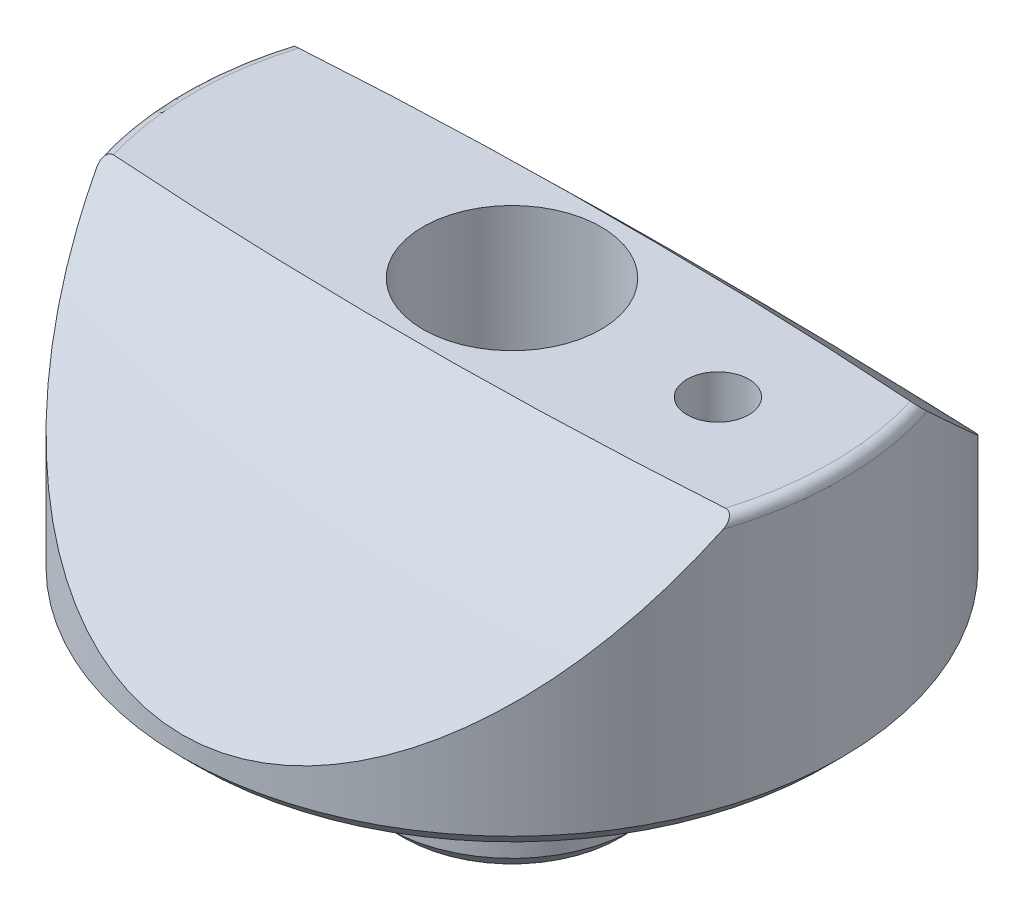
ISO-10303-21;
HEADER;
FILE_DESCRIPTION(('STEP AP214'),'2;1');
FILE_NAME('part.step','',(''),(''),'','','');
FILE_SCHEMA(('AUTOMOTIVE_DESIGN { 1 0 10303 214 1 1 1 1 }'));
ENDSEC;
DATA;
#1=APPLICATION_CONTEXT('core data for automotive mechanical design processes');
#2=APPLICATION_PROTOCOL_DEFINITION('international standard','automotive_design',2000,#1);
#3=PRODUCT_CONTEXT('',#1,'mechanical');
#4=PRODUCT('Part','Part','',(#3));
#5=PRODUCT_RELATED_PRODUCT_CATEGORY('part','',(#4));
#6=PRODUCT_DEFINITION_FORMATION('','',#4);
#7=PRODUCT_DEFINITION_CONTEXT('part definition',#1,'design');
#8=PRODUCT_DEFINITION('design','',#6,#7);
#9=PRODUCT_DEFINITION_SHAPE('','',#8);
#10=(LENGTH_UNIT() NAMED_UNIT(*) SI_UNIT(.MILLI.,.METRE.));
#11=(NAMED_UNIT(*) PLANE_ANGLE_UNIT() SI_UNIT($,.RADIAN.));
#12=(NAMED_UNIT(*) SI_UNIT($,.STERADIAN.) SOLID_ANGLE_UNIT());
#13=UNCERTAINTY_MEASURE_WITH_UNIT(LENGTH_MEASURE(1.E-05),#10,'distance_accuracy_value','');
#14=(GEOMETRIC_REPRESENTATION_CONTEXT(3) GLOBAL_UNCERTAINTY_ASSIGNED_CONTEXT((#13)) GLOBAL_UNIT_ASSIGNED_CONTEXT((#10,
#11,#12)) REPRESENTATION_CONTEXT('',''));
#15=CARTESIAN_POINT('',(0.,0.,0.));
#16=DIRECTION('',(0.,0.,1.));
#17=DIRECTION('',(1.,0.,0.));
#18=AXIS2_PLACEMENT_3D('',#15,#16,#17);
#19=CARTESIAN_POINT('',(9.525,0.,0.));
#20=DIRECTION('',(0.,1.,0.));
#21=DIRECTION('',(0.,0.,1.));
#22=AXIS2_PLACEMENT_3D('',#19,#20,#21);
#23=PLANE('',#22);
#24=CARTESIAN_POINT('',(0.,0.,0.));
#25=DIRECTION('',(0.,1.,0.));
#26=DIRECTION('',(0.,0.,1.));
#27=AXIS2_PLACEMENT_3D('',#24,#25,#26);
#28=CIRCLE('',#27,11.1939614104249);
#29=CARTESIAN_POINT('',(0.,0.,11.1939614104249));
#30=VERTEX_POINT('',#29);
#31=EDGE_CURVE('E507',#30,#30,#28,.F.);
#32=ORIENTED_EDGE('',*,*,#31,.F.);
#33=EDGE_LOOP('',(#32));
#34=FACE_BOUND('',#33,.T.);
#35=CARTESIAN_POINT('',(0.,0.,0.));
#36=DIRECTION('',(0.,-1.,0.));
#37=DIRECTION('',(0.,0.,-1.));
#38=AXIS2_PLACEMENT_3D('',#35,#36,#37);
#39=CIRCLE('',#38,16.4465);
#40=CARTESIAN_POINT('',(16.27819325,0.,2.34686743674508));
#41=VERTEX_POINT('',#40);
#42=CARTESIAN_POINT('',(16.27819325,0.,-2.34686743674508));
#43=VERTEX_POINT('',#42);
#44=EDGE_CURVE('E398',#41,#43,#39,.T.);
#45=ORIENTED_EDGE('',*,*,#44,.T.);
#46=CARTESIAN_POINT('',(15.875,0.,0.));
#47=DIRECTION('',(0.,1.,0.));
#48=DIRECTION('',(0.,0.,1.));
#49=AXIS2_PLACEMENT_3D('',#46,#47,#48);
#50=CIRCLE('',#49,2.38125);
#51=EDGE_CURVE('E509',#43,#41,#50,.T.);
#52=ORIENTED_EDGE('',*,*,#51,.T.);
#53=EDGE_LOOP('',(#45,#52));
#54=FACE_BOUND('',#53,.T.);
#55=ADVANCED_FACE('F343',(#34,#54),#23,.F.);
#56=CARTESIAN_POINT('',(15.875,-12.7,0.));
#57=DIRECTION('',(0.,1.,0.));
#58=DIRECTION('',(0.,0.,1.));
#59=AXIS2_PLACEMENT_3D('',#56,#57,#58);
#60=CYLINDRICAL_SURFACE('',#59,2.38125);
#61=CARTESIAN_POINT('',(15.875,20.574,0.));
#62=DIRECTION('',(0.,1.,0.));
#63=DIRECTION('',(0.,0.,1.));
#64=AXIS2_PLACEMENT_3D('',#61,#62,#63);
#65=CIRCLE('',#64,2.38125);
#66=CARTESIAN_POINT('',(15.875,20.574,2.38125));
#67=VERTEX_POINT('',#66);
#68=EDGE_CURVE('E510',#67,#67,#65,.T.);
#69=ORIENTED_EDGE('',*,*,#68,.T.);
#70=EDGE_LOOP('',(#69));
#71=FACE_BOUND('',#70,.T.);
#72=DIRECTION('',(0.,-1.,0.));
#73=VECTOR('',#72,1.);
#74=CARTESIAN_POINT('',(16.27819325,0.0381,2.34686743674508));
#75=LINE('',#74,#73);
#76=CARTESIAN_POINT('',(16.27819325,0.0762,2.34686743674508));
#77=VERTEX_POINT('',#76);
#78=EDGE_CURVE('E14',#41,#77,#75,.F.);
#79=ORIENTED_EDGE('',*,*,#78,.F.);
#80=ORIENTED_EDGE('',*,*,#51,.F.);
#81=DIRECTION('',(0.,-1.,0.));
#82=VECTOR('',#81,1.);
#83=CARTESIAN_POINT('',(16.27819325,0.0381,-2.34686743674508));
#84=LINE('',#83,#82);
#85=CARTESIAN_POINT('',(16.27819325,0.0762,-2.34686743674508));
#86=VERTEX_POINT('',#85);
#87=EDGE_CURVE('E409',#86,#43,#84,.T.);
#88=ORIENTED_EDGE('',*,*,#87,.F.);
#89=CARTESIAN_POINT('',(15.875,0.0762000000000002,0.));
#90=DIRECTION('',(0.,-1.,0.));
#91=DIRECTION('',(0.,0.,-1.));
#92=AXIS2_PLACEMENT_3D('',#89,#90,#91);
#93=CIRCLE('',#92,2.38125);
#94=EDGE_CURVE('E352',#77,#86,#93,.F.);
#95=ORIENTED_EDGE('',*,*,#94,.F.);
#96=EDGE_LOOP('',(#79,#80,#88,#95));
#97=FACE_BOUND('',#96,.T.);
#98=ADVANCED_FACE('F408',(#71,#97),#60,.F.);
#99=CARTESIAN_POINT('',(0.,0.,0.));
#100=DIRECTION('',(0.,-1.,0.));
#101=DIRECTION('',(0.,0.,-1.));
#102=AXIS2_PLACEMENT_3D('',#99,#100,#101);
#103=CIRCLE('',#102,19.939);
#104=CARTESIAN_POINT('',(0.,0.,-19.939));
#105=VERTEX_POINT('',#104);
#106=EDGE_CURVE('E406',#105,#105,#103,.T.);
#107=ORIENTED_EDGE('',*,*,#106,.F.);
#108=EDGE_LOOP('',(#107));
#109=FACE_BOUND('',#108,.T.);
#110=CARTESIAN_POINT('',(0.,0.,0.));
#111=DIRECTION('',(0.,1.,0.));
#112=DIRECTION('',(0.,0.,1.));
#113=AXIS2_PLACEMENT_3D('',#110,#111,#112);
#114=CIRCLE('',#113,24.13);
#115=CARTESIAN_POINT('',(0.,0.,24.13));
#116=VERTEX_POINT('',#115);
#117=EDGE_CURVE('E489',#116,#116,#114,.F.);
#118=ORIENTED_EDGE('',*,*,#117,.T.);
#119=EDGE_LOOP('',(#118));
#120=FACE_BOUND('',#119,.T.);
#121=ADVANCED_FACE('F527',(#109,#120),#23,.F.);
#122=CARTESIAN_POINT('',(0.,-19.9423816568047,0.));
#123=DIRECTION('',(0.,1.,0.));
#124=DIRECTION('',(0.,0.,1.));
#125=AXIS2_PLACEMENT_3D('',#122,#123,#124);
#126=CYLINDRICAL_SURFACE('',#125,9.525);
#127=CARTESIAN_POINT('',(0.,-11.43,0.));
#128=DIRECTION('',(0.,1.,0.));
#129=DIRECTION('',(0.,0.,1.));
#130=AXIS2_PLACEMENT_3D('',#127,#128,#129);
#131=CIRCLE('',#130,9.525);
#132=CARTESIAN_POINT('',(0.,-11.43,9.525));
#133=VERTEX_POINT('',#132);
#134=EDGE_CURVE('E500',#133,#133,#131,.T.);
#135=ORIENTED_EDGE('',*,*,#134,.T.);
#136=EDGE_LOOP('',(#135));
#137=FACE_BOUND('',#136,.T.);
#138=CARTESIAN_POINT('',(0.,-1.905,0.));
#139=DIRECTION('',(0.,1.,0.));
#140=DIRECTION('',(0.,0.,1.));
#141=AXIS2_PLACEMENT_3D('',#138,#139,#140);
#142=CIRCLE('',#141,9.525);
#143=CARTESIAN_POINT('',(0.,-1.905,9.525));
#144=VERTEX_POINT('',#143);
#145=EDGE_CURVE('E504',#144,#144,#142,.T.);
#146=ORIENTED_EDGE('',*,*,#145,.F.);
#147=EDGE_LOOP('',(#146));
#148=FACE_BOUND('',#147,.T.);
#149=ADVANCED_FACE('F531',(#137,#148),#126,.T.);
#150=CARTESIAN_POINT('',(0.,-338.440390593273,340.074622230067));
#151=DIRECTION('',(0.,1.,0.));
#152=DIRECTION('',(-0.0784590957278451,0.,-0.996917333733128));
#153=AXIS2_PLACEMENT_3D('',#150,#151,#152);
#154=SPHERICAL_SURFACE('',#153,500.);
#155=CARTESIAN_POINT('',(24.3944921571215,20.574099999261,-7.07592767231115));
#156=CARTESIAN_POINT('',(24.2844416624212,20.2147401360685,-7.45530256202201));
#157=CARTESIAN_POINT('',(24.1652921717439,19.8564061125691,-7.83302268375219));
#158=CARTESIAN_POINT('',(23.9086078529988,19.1422880913933,-8.58465487511524));
#159=CARTESIAN_POINT('',(23.7710717953683,18.7865042659341,-8.95856668827432));
#160=CARTESIAN_POINT('',(23.4772504334057,18.0775717848319,-9.7025170625566));
#161=CARTESIAN_POINT('',(23.3209409395701,17.7244271654631,-10.0725499439138));
#162=CARTESIAN_POINT('',(22.9895080730878,17.0218534421277,-10.8076395247218));
#163=CARTESIAN_POINT('',(22.8143848310792,16.6724243123803,-11.1726962587058));
#164=CARTESIAN_POINT('',(22.2566926458501,15.6236234557583,-12.2668029737867));
#165=CARTESIAN_POINT('',(21.8446952050512,14.9307785751224,-12.9874026333146));
#166=CARTESIAN_POINT('',(20.9406561558842,13.5689921552193,-14.3997058154994));
#167=CARTESIAN_POINT('',(20.4486597750909,12.9000373687564,-15.0914253894778));
#168=CARTESIAN_POINT('',(19.5126704115289,11.7534554901934,-16.2737885290337));
#169=CARTESIAN_POINT('',(19.0865244328694,11.2691607142015,-16.7721211043043));
#170=CARTESIAN_POINT('',(18.1855559702739,10.3217971324358,-17.7450054048349));
#171=CARTESIAN_POINT('',(17.7107193140282,9.85873456376416,-18.21955014603));
#172=CARTESIAN_POINT('',(16.7129630489345,8.95998069056407,-19.1388504755221));
#173=CARTESIAN_POINT('',(16.1901993535621,8.5242078855042,-19.5836950548552));
#174=CARTESIAN_POINT('',(15.0948638781341,7.68402842940703,-20.4398582482011));
#175=CARTESIAN_POINT('',(14.5223251149066,7.27960131788766,-20.8511987406375));
#176=CARTESIAN_POINT('',(13.461115434683,6.59456772533196,-21.54682774502));
#177=CARTESIAN_POINT('',(12.9823696929763,6.30651259917076,-21.8389418260906));
#178=CARTESIAN_POINT('',(11.9952443539439,5.75624466468865,-22.3963246083477));
#179=CARTESIAN_POINT('',(11.4868662682854,5.49403053994544,-22.6615946770715));
#180=CARTESIAN_POINT('',(10.4415307618001,4.99906213174441,-23.1618207764442));
#181=CARTESIAN_POINT('',(9.90457683419653,4.76630425913572,-23.3967805003801));
#182=CARTESIAN_POINT('',(9.07942382168111,4.44221214446574,-23.7236516395974));
#183=CARTESIAN_POINT('',(8.8010978417354,4.33835937243127,-23.8283434369506));
#184=CARTESIAN_POINT('',(8.23807078535955,4.13942069021687,-24.0288057938905));
#185=CARTESIAN_POINT('',(7.95336802896027,4.04433712487705,-24.1245739674172));
#186=CARTESIAN_POINT('',(7.18151910604424,3.80166087566788,-24.3689055918595));
#187=CARTESIAN_POINT('',(6.68890367503006,3.66255528683672,-24.5088580707544));
#188=CARTESIAN_POINT('',(5.6894112820588,3.41284214780672,-24.759968978753));
#189=CARTESIAN_POINT('',(5.18253697936359,3.30222932231664,-24.8711327379632));
#190=CARTESIAN_POINT('',(4.15856203854267,3.11158155664318,-25.0626621368926));
#191=CARTESIAN_POINT('',(3.64148758684746,3.03147690959551,-25.1430979868315));
#192=CARTESIAN_POINT('',(2.59967504453081,2.90302118149483,-25.2720573662058));
#193=CARTESIAN_POINT('',(2.07494149796201,2.8546519970861,-25.3205990895286));
#194=CARTESIAN_POINT('',(1.29093460706296,2.80693124745203,-25.3684863896088));
#195=CARTESIAN_POINT('',(1.03307590505299,2.79516196037675,-25.3802958625408));
#196=CARTESIAN_POINT('',(0.516849469841227,2.77945680404613,-25.3960542557659));
#197=CARTESIAN_POINT('',(0.258481674494671,2.7755219591612,-25.4000021481401));
#198=CARTESIAN_POINT('',(-0.567943371010588,2.77552911470026,-25.3999952777214));
#199=CARTESIAN_POINT('',(-1.13615216950248,2.79455744961882,-25.3809045259433));
#200=CARTESIAN_POINT('',(-2.2677805103523,2.8702707648339,-25.3049242899638));
#201=CARTESIAN_POINT('',(-2.83119648050204,2.92698169955655,-25.2480087533999));
#202=CARTESIAN_POINT('',(-3.94958330394526,3.07697877753924,-25.0974083892714));
#203=CARTESIAN_POINT('',(-4.5045298944935,3.17035480553412,-25.0036331994219));
#204=CARTESIAN_POINT('',(-5.60021547131089,3.3916709421843,-24.7812452384722));
#205=CARTESIAN_POINT('',(-6.14095654515576,3.51960594068558,-24.6526376179545));
#206=CARTESIAN_POINT('',(-7.20079239112261,3.80646039980167,-24.3640712898771));
#207=CARTESIAN_POINT('',(-7.72002068682445,3.96513638791227,-24.2043588869002));
#208=CARTESIAN_POINT('',(-8.7385326973801,4.3113834510972,-23.8555622584938));
#209=CARTESIAN_POINT('',(-9.23781614611619,4.49895491155252,-23.6664776413248));
#210=CARTESIAN_POINT('',(-10.2143455081615,4.90012128235093,-23.2616952100965));
#211=CARTESIAN_POINT('',(-10.69159919374,5.11370691641576,-23.0460068821898));
#212=CARTESIAN_POINT('',(-11.623120171506,5.56427743252574,-22.5905278205063));
#213=CARTESIAN_POINT('',(-12.0773820530385,5.80126778402816,-22.3507314526758));
#214=CARTESIAN_POINT('',(-12.8327570871919,6.22369997785852,-21.92281587919));
#215=CARTESIAN_POINT('',(-13.1398441001732,6.40397687556355,-21.7400634838293));
#216=CARTESIAN_POINT('',(-13.7418533726413,6.77402200027108,-21.3646269916132));
#217=CARTESIAN_POINT('',(-14.0367781570815,6.96378823894294,-21.1719449750853));
#218=CARTESIAN_POINT('',(-14.9035187451797,7.54630997388088,-20.5799610074919));
#219=CARTESIAN_POINT('',(-15.4571780134245,7.95221922951152,-20.1667912614841));
#220=CARTESIAN_POINT('',(-16.5170653105967,8.79396936289482,-19.3083625332552));
#221=CARTESIAN_POINT('',(-17.0231839404454,9.22987546200701,-18.8630335170819));
#222=CARTESIAN_POINT('',(-17.9874860160775,10.1258789983202,-17.945837549533));
#223=CARTESIAN_POINT('',(-18.4456697758258,10.5859762770437,-17.4739707720059));
#224=CARTESIAN_POINT('',(-19.4749280241358,11.6988631750387,-16.3302494195567));
#225=CARTESIAN_POINT('',(-20.0256966867762,12.3603849938487,-15.6485705813433));
#226=CARTESIAN_POINT('',(-21.04292824638,13.7122354635725,-14.2513967488653));
#227=CARTESIAN_POINT('',(-21.5093507642279,14.4025777180984,-13.5358857637775));
#228=CARTESIAN_POINT('',(-22.3599933183509,15.8039911348689,-12.0789663871399));
#229=CARTESIAN_POINT('',(-22.7443075414949,16.5150374713765,-11.3375888158356));
#230=CARTESIAN_POINT('',(-23.4336078388934,17.9525895196684,-9.83409348657545));
#231=CARTESIAN_POINT('',(-23.7386388614816,18.6790862182537,-9.07198775204374));
#232=CARTESIAN_POINT('',(-24.0752905962118,19.6041582777011,-8.09856053401499));
#233=CARTESIAN_POINT('',(-24.1429347645022,19.7978283560729,-7.89460186353896));
#234=CARTESIAN_POINT('',(-24.2727654914871,20.1855937853059,-7.48590426654944));
#235=CARTESIAN_POINT('',(-24.3349592660786,20.3796882142194,-7.281166757888));
#236=CARTESIAN_POINT('',(-24.3944921566802,20.5740999989505,-7.07592767187955));
#237=B_SPLINE_CURVE_WITH_KNOTS('',3,(#155,#156,#157,#158,#159,#160,#161,#162,#163,#164,#165,
#166,#167,#168,#169,#170,#171,#172,#173,#174,#175,#176,#177,#178,#179,#180,#181,#182,#183,#184,
#185,#186,#187,#188,#189,#190,#191,#192,#193,#194,#195,#196,#197,#198,#199,#200,#201,#202,#203,
#204,#205,#206,#207,#208,#209,#210,#211,#212,#213,#214,#215,#216,#217,#218,#219,#220,#221,#222,
#223,#224,#225,#226,#227,#228,#229,#230,#231,#232,#233,#234,#235,#236),.UNSPECIFIED.,.F.,.F.,(4,
2,2,2,2,2,2,2,2,2,2,2,2,2,2,2,2,2,2,2,2,2,2,2,2,2,2,2,2,2,2,2,2,2,2,2,2,2,2,2,4),(0.,
1.60198643014716,3.20408004338351,4.80826055259946,6.41242992349487,9.65250819343477,
12.8907610067085,15.3343726039149,17.778697488712,20.2153351647142,22.6503687238822,
24.540182388981,26.4298997311777,28.3193865951628,29.2640510679009,30.2089674110342,
31.7992052616039,33.389148475703,34.9754367837035,36.5608194119151,37.3358031538908,
38.1108882200282,39.8146402443163,41.5195669701023,43.2286996957798,44.9375798342138,
46.6334412929824,48.3293253715358,50.0246064831306,51.7202847073056,52.9206226164199,
54.1207100604176,56.5213555555834,58.927396534851,61.3334217539985,64.6227210577236,
67.9135909062338,71.2006652673317,74.4858719896132,75.3536821830104,76.2203255365439),.UNSPECIFIED.);
#238=CARTESIAN_POINT('',(24.1468761263846,19.812,-7.87961758824868));
#239=VERTEX_POINT('',#238);
#240=CARTESIAN_POINT('',(-24.1468761263846,19.812,-7.87961758824875));
#241=VERTEX_POINT('',#240);
#242=EDGE_CURVE('E467',#239,#241,#237,.T.);
#243=ORIENTED_EDGE('',*,*,#242,.T.);
#244=CARTESIAN_POINT('',(-24.1468761263845,19.812,-7.87961758824883));
#245=CARTESIAN_POINT('',(-24.1542282244913,19.8334012428195,-7.85707273046058));
#246=CARTESIAN_POINT('',(-24.1606464071236,19.8549800843352,-7.83440543847279));
#247=CARTESIAN_POINT('',(-24.171476610489,19.8984730756175,-7.78885605950476));
#248=CARTESIAN_POINT('',(-24.1758859363597,19.9203876352755,-7.76597372577525));
#249=CARTESIAN_POINT('',(-24.1859305680268,19.9869426968998,-7.69669872116227));
#250=CARTESIAN_POINT('',(-24.1882346696052,20.0319800397091,-7.65011511699737));
#251=CARTESIAN_POINT('',(-24.1830219652066,20.1108396088488,-7.56915972172477));
#252=CARTESIAN_POINT('',(-24.177808481007,20.1446610399161,-7.53463639800978));
#253=CARTESIAN_POINT('',(-24.1604562452226,20.2116048101498,-7.46677225348889));
#254=CARTESIAN_POINT('',(-24.1483406913369,20.2447291076066,-7.43342786700081));
#255=CARTESIAN_POINT('',(-24.1197734874263,20.3018920326705,-7.37639960817118));
#256=CARTESIAN_POINT('',(-24.1049499761552,20.3262743175894,-7.35225198944822));
#257=CARTESIAN_POINT('',(-24.0700227444624,20.3732908382275,-7.30611616455611));
#258=CARTESIAN_POINT('',(-24.0499238375287,20.3959266432678,-7.28412601482402));
#259=CARTESIAN_POINT('',(-24.0086414583551,20.4343110657221,-7.24732431140613));
#260=CARTESIAN_POINT('',(-23.9884184967672,20.4505452193441,-7.2319467753234));
#261=CARTESIAN_POINT('',(-23.9445492938285,20.4805624765811,-7.2039531333015));
#262=CARTESIAN_POINT('',(-23.9209078163515,20.4943489325831,-7.19133324490835));
#263=CARTESIAN_POINT('',(-23.8705749685308,20.5189383168163,-7.16937951495631));
#264=CARTESIAN_POINT('',(-23.8438717086808,20.5297290165763,-7.16005910026987));
#265=CARTESIAN_POINT('',(-23.7882876957867,20.5478528648947,-7.14513431968691));
#266=CARTESIAN_POINT('',(-23.7594037486181,20.5551808228671,-7.13953552735685));
#267=CARTESIAN_POINT('',(-23.7058810272536,20.5652477415228,-7.13278474615112));
#268=CARTESIAN_POINT('',(-23.6814242158963,20.5685785020351,-7.13100972837479));
#269=CARTESIAN_POINT('',(-23.6323221761507,20.5729577942969,-7.12982710269596));
#270=CARTESIAN_POINT('',(-23.607677773323,20.5740134117042,-7.1304121283301));
#271=CARTESIAN_POINT('',(-23.5831358057492,20.574,-7.1320929303809));
#272=B_SPLINE_CURVE_WITH_KNOTS('',3,(#244,#245,#246,#247,#248,#249,#250,#251,#252,#253,#254,
#255,#256,#257,#258,#259,#260,#261,#262,#263,#264,#265,#266,#267,#268,#269,#270,#271),
.UNSPECIFIED.,.F.,.F.,(4,2,2,2,2,2,2,2,2,2,2,2,2,4),(0.,0.0957900297678136,0.191708185298794,
0.385391729103336,0.530830821990487,0.675783957178881,0.787545449652843,0.899205318723338,
0.989282965241661,1.07923627262562,1.16955153808427,1.26000175833691,1.33402136430599,
1.40781011004683),.UNSPECIFIED.);
#273=CARTESIAN_POINT('',(-23.5831358057492,20.574,-7.13209293038086));
#274=VERTEX_POINT('',#273);
#275=EDGE_CURVE('E424',#241,#274,#272,.T.);
#276=ORIENTED_EDGE('',*,*,#275,.T.);
#277=CARTESIAN_POINT('',(0.,20.574,340.074622230067));
#278=DIRECTION('',(0.,-1.,0.));
#279=DIRECTION('',(0.,0.,-1.));
#280=AXIS2_PLACEMENT_3D('',#277,#278,#279);
#281=CIRCLE('',#280,348.006705893638);
#282=CARTESIAN_POINT('',(23.5831358057492,20.574,-7.13209293038086));
#283=VERTEX_POINT('',#282);
#284=EDGE_CURVE('E470',#274,#283,#281,.T.);
#285=ORIENTED_EDGE('',*,*,#284,.T.);
#286=CARTESIAN_POINT('',(23.5831358057492,20.574,-7.13209293038086));
#287=CARTESIAN_POINT('',(23.6124811447624,20.5740356534211,-7.13006290062341));
#288=CARTESIAN_POINT('',(23.6420015333541,20.5725117890647,-7.12962970471838));
#289=CARTESIAN_POINT('',(23.7005686803831,20.566190130218,-7.13217336101993));
#290=CARTESIAN_POINT('',(23.7296147975629,20.5613882272175,-7.13515449573899));
#291=CARTESIAN_POINT('',(23.786456428991,20.5483260691139,-7.14477048581384));
#292=CARTESIAN_POINT('',(23.8142458781921,20.5400506900869,-7.15142135997372));
#293=CARTESIAN_POINT('',(23.8674503974493,20.520256955154,-7.16823111303593));
#294=CARTESIAN_POINT('',(23.8928693148935,20.5087439803107,-7.1783841773973));
#295=CARTESIAN_POINT('',(23.9394864942457,20.4835716912558,-7.2011918927679));
#296=CARTESIAN_POINT('',(23.9608314665921,20.4700469669269,-7.21369769212002));
#297=CARTESIAN_POINT('',(24.0004808896812,20.4409804589724,-7.24099679853016));
#298=CARTESIAN_POINT('',(24.0187817101778,20.4254363058862,-7.25579279671868));
#299=CARTESIAN_POINT('',(24.0586769922575,20.38658443156,-7.29317070565034));
#300=CARTESIAN_POINT('',(24.0788408457393,20.3625863384449,-7.31656171094903));
#301=CARTESIAN_POINT('',(24.1134994370235,20.3128335638084,-7.36553783774666));
#302=CARTESIAN_POINT('',(24.1279849904044,20.2870761149563,-7.39112643294347));
#303=CARTESIAN_POINT('',(24.1569074666123,20.2235212196738,-7.45472222010132));
#304=CARTESIAN_POINT('',(24.1687424153004,20.1852313118001,-7.49341178919264));
#305=CARTESIAN_POINT('',(24.1837881500732,20.1080668185118,-7.57196726203017));
#306=CARTESIAN_POINT('',(24.1869688698901,20.0691906653874,-7.61183678158351));
#307=CARTESIAN_POINT('',(24.1860218974944,19.9933077056356,-7.69013032284492));
#308=CARTESIAN_POINT('',(24.1821809244908,19.9562882343213,-7.72854850358342));
#309=CARTESIAN_POINT('',(24.168645232015,19.8833331018116,-7.8046505532707));
#310=CARTESIAN_POINT('',(24.1590097750318,19.8473902848433,-7.84233792143492));
#311=CARTESIAN_POINT('',(24.146876126385,19.812,-7.87961758824871));
#312=B_SPLINE_CURVE_WITH_KNOTS('',3,(#286,#287,#288,#289,#290,#291,#292,#293,#294,#295,#296,
#297,#298,#299,#300,#301,#302,#303,#304,#305,#306,#307,#308,#309,#310,#311),.UNSPECIFIED.,.F.,
.F.,(4,2,2,2,2,2,2,2,2,2,2,2,4),(0.,0.0882614122069741,0.176633649922497,0.265394729090601,
0.354009145631909,0.43823347042719,0.522557526249088,0.639236936117429,0.756104299104161,
0.922306888775804,1.08908616172819,1.24920674988832,1.40771692774801),.UNSPECIFIED.);
#313=EDGE_CURVE('E431',#283,#239,#312,.T.);
#314=ORIENTED_EDGE('',*,*,#313,.T.);
#315=EDGE_LOOP('',(#243,#276,#285,#314));
#316=FACE_BOUND('',#315,.T.);
#317=ADVANCED_FACE('F437',(#316),#154,.T.);
#318=CARTESIAN_POINT('',(-25.4,20.574,7.9375));
#319=DIRECTION('',(0.,-1.,0.));
#320=DIRECTION('',(0.,0.,-1.));
#321=AXIS2_PLACEMENT_3D('',#318,#319,#320);
#322=PLANE('',#321);
#323=ORIENTED_EDGE('',*,*,#68,.F.);
#324=EDGE_LOOP('',(#323));
#325=FACE_BOUND('',#324,.T.);
#326=CARTESIAN_POINT('',(0.,20.574,0.));
#327=DIRECTION('',(0.,1.,0.));
#328=DIRECTION('',(0.,0.,1.));
#329=AXIS2_PLACEMENT_3D('',#326,#327,#328);
#330=CIRCLE('',#329,6.858);
#331=CARTESIAN_POINT('',(0.,20.574,6.858));
#332=VERTEX_POINT('',#331);
#333=EDGE_CURVE('E577',#332,#332,#330,.T.);
#334=ORIENTED_EDGE('',*,*,#333,.F.);
#335=EDGE_LOOP('',(#334));
#336=FACE_BOUND('',#335,.T.);
#337=ORIENTED_EDGE('',*,*,#284,.F.);
#338=CARTESIAN_POINT('',(0.,20.574,0.));
#339=DIRECTION('',(0.,-1.,0.));
#340=DIRECTION('',(0.,0.,-1.));
#341=AXIS2_PLACEMENT_3D('',#338,#339,#340);
#342=CIRCLE('',#341,24.638);
#343=CARTESIAN_POINT('',(-23.5831358057492,20.5739999999999,7.13209293038097));
#344=VERTEX_POINT('',#343);
#345=EDGE_CURVE('E485',#274,#344,#342,.F.);
#346=ORIENTED_EDGE('',*,*,#345,.T.);
#347=CARTESIAN_POINT('',(0.,20.5739999999999,-340.074622230067));
#348=DIRECTION('',(0.,1.,0.));
#349=DIRECTION('',(0.,0.,1.));
#350=AXIS2_PLACEMENT_3D('',#347,#348,#349);
#351=CIRCLE('',#350,348.006705893638);
#352=CARTESIAN_POINT('',(23.5831358057492,20.5739999999999,7.13209293038097));
#353=VERTEX_POINT('',#352);
#354=EDGE_CURVE('E503',#344,#353,#351,.T.);
#355=ORIENTED_EDGE('',*,*,#354,.T.);
#356=CARTESIAN_POINT('',(0.,20.574,0.));
#357=DIRECTION('',(0.,-1.,0.));
#358=DIRECTION('',(0.,0.,-1.));
#359=AXIS2_PLACEMENT_3D('',#356,#357,#358);
#360=CIRCLE('',#359,24.638);
#361=EDGE_CURVE('E481',#353,#283,#360,.F.);
#362=ORIENTED_EDGE('',*,*,#361,.T.);
#363=EDGE_LOOP('',(#337,#346,#355,#362));
#364=FACE_BOUND('',#363,.T.);
#365=ADVANCED_FACE('F525',(#325,#336,#364),#322,.F.);
#366=CARTESIAN_POINT('',(0.,-19.9423816568047,0.));
#367=DIRECTION('',(0.,1.,0.));
#368=DIRECTION('',(0.,0.,1.));
#369=AXIS2_PLACEMENT_3D('',#366,#367,#368);
#370=CYLINDRICAL_SURFACE('',#369,25.4);
#371=CARTESIAN_POINT('',(0.,1.27,0.));
#372=DIRECTION('',(0.,1.,0.));
#373=DIRECTION('',(0.,0.,1.));
#374=AXIS2_PLACEMENT_3D('',#371,#372,#373);
#375=CIRCLE('',#374,25.4);
#376=CARTESIAN_POINT('',(0.,1.27,25.4));
#377=VERTEX_POINT('',#376);
#378=EDGE_CURVE('E494',#377,#377,#375,.T.);
#379=ORIENTED_EDGE('',*,*,#378,.T.);
#380=EDGE_LOOP('',(#379));
#381=FACE_BOUND('',#380,.T.);
#382=CARTESIAN_POINT('',(24.3944941565746,20.5741065299244,7.07592077717432));
#383=CARTESIAN_POINT('',(24.2844437722947,20.2147466535097,7.45529568823151));
#384=CARTESIAN_POINT('',(24.1652943922243,19.8564126152173,7.83301583261753));
#385=CARTESIAN_POINT('',(23.9086102954836,19.142294561264,8.58464807224653));
#386=CARTESIAN_POINT('',(23.7710743492524,18.7865107178197,8.95855991101632));
#387=CARTESIAN_POINT('',(23.4772532116256,18.0775781979391,9.7025103393622));
#388=CARTESIAN_POINT('',(23.3209438307555,17.724433557768,10.0725432491832));
#389=CARTESIAN_POINT('',(22.9895111915717,17.0218597891667,10.807632890522));
#390=CARTESIAN_POINT('',(22.8143880638957,16.6724306349557,11.1726896565729));
#391=CARTESIAN_POINT('',(22.2566962309005,15.6236297070069,12.266796465474));
#392=CARTESIAN_POINT('',(21.8446990314537,14.9307847732346,12.987396192988));
#393=CARTESIAN_POINT('',(20.940660474483,13.5689982264401,14.3996995313407));
#394=CARTESIAN_POINT('',(20.4486643444713,12.9000433662502,15.0914191934695));
#395=CARTESIAN_POINT('',(19.5126753135415,11.7534611933557,16.2737826564695));
#396=CARTESIAN_POINT('',(19.0865294008517,11.2691662073367,16.7721154558336));
#397=CARTESIAN_POINT('',(18.1855610476117,10.3218022018387,17.7450002062241));
#398=CARTESIAN_POINT('',(17.7107244347387,9.85873941946367,18.2195451731829));
#399=CARTESIAN_POINT('',(16.7129682268812,8.95998511239357,19.1388459587281));
#400=CARTESIAN_POINT('',(16.1902045449471,8.52421208743734,19.5836907680624));
#401=CARTESIAN_POINT('',(15.094869068893,7.68403219133647,20.4398544196197));
#402=CARTESIAN_POINT('',(14.522330291625,7.27960485970647,20.8511951402711));
#403=CARTESIAN_POINT('',(13.4611206023006,6.59457090582654,21.5468245182603));
#404=CARTESIAN_POINT('',(12.9823748743275,6.30651563591874,21.8389387477381));
#405=CARTESIAN_POINT('',(11.9952495485168,5.75624741196086,22.3963218278931));
#406=CARTESIAN_POINT('',(11.4868714623533,5.4940331414832,22.6615920461131));
#407=CARTESIAN_POINT('',(10.4415359527747,4.99906444764621,23.1618184377294));
#408=CARTESIAN_POINT('',(9.9045820233541,4.7663064343456,23.396778305226));
#409=CARTESIAN_POINT('',(9.07942899538901,4.44221410794661,23.7236496599267));
#410=CARTESIAN_POINT('',(8.80110300802292,4.33836126517591,23.8283415291763));
#411=CARTESIAN_POINT('',(8.23807593259878,4.13942244161427,24.028804029612));
#412=CARTESIAN_POINT('',(7.95337316457529,4.04433880565666,24.1245722747448));
#413=CARTESIAN_POINT('',(7.18152470090767,3.80166252358363,24.3689039334239));
#414=CARTESIAN_POINT('',(6.68890975398594,3.66255694594707,24.5088564017553));
#415=CARTESIAN_POINT('',(5.6894183420487,3.41284377135731,24.7599673467175));
#416=CARTESIAN_POINT('',(5.18254453627889,3.30223089915073,24.8711311534167));
#417=CARTESIAN_POINT('',(4.15857055761051,3.11158297329777,25.0626607141068));
#418=CARTESIAN_POINT('',(3.64149657045269,3.03147821476071,25.1430966763305));
#419=CARTESIAN_POINT('',(2.59968494377311,2.90302220481548,25.2720563390939));
#420=CARTESIAN_POINT('',(2.07495184813193,2.85465285077408,25.3205982327953));
#421=CARTESIAN_POINT('',(1.29091891428511,2.80693018277786,25.3684874580266));
#422=CARTESIAN_POINT('',(1.03303364572303,2.79515997663057,25.3802978530628));
#423=CARTESIAN_POINT('',(0.516754017922317,2.77945459860897,25.3960564686312));
#424=CARTESIAN_POINT('',(0.2583595965308,2.77552045133074,25.4000036610182));
#425=CARTESIAN_POINT('',(-0.568093994949035,2.77553242831713,25.3999919529907));
#426=CARTESIAN_POINT('',(-1.13630451698643,2.79456420868441,25.3808977442142));
#427=CARTESIAN_POINT('',(-2.26793581906478,2.87028459557797,25.304910409339));
#428=CARTESIAN_POINT('',(-2.83135302664875,2.92699915606582,25.2479912313418));
#429=CARTESIAN_POINT('',(-3.94974181316546,3.07700358532686,25.097383477048));
#430=CARTESIAN_POINT('',(-4.50468912848536,3.17038333775743,25.0036045395325));
#431=CARTESIAN_POINT('',(-5.60037568623473,3.39170693652086,24.7812090593346));
#432=CARTESIAN_POINT('',(-6.14111701624058,3.51964567286654,24.6525976670682));
#433=CARTESIAN_POINT('',(-7.20095286989134,3.80650750928743,24.3640238810153));
#434=CARTESIAN_POINT('',(-7.72018092281871,3.96518713279026,24.2043077960324));
#435=CARTESIAN_POINT('',(-8.73869208085713,4.31144136390284,23.855503891604));
#436=CARTESIAN_POINT('',(-9.23797491988101,4.49901635684089,23.6664156804722));
#437=CARTESIAN_POINT('',(-10.2145027533581,4.9001896608954,23.2616261769204));
#438=CARTESIAN_POINT('',(-10.6917555200906,5.11377869590049,23.0459343704889));
#439=CARTESIAN_POINT('',(-11.6232743987119,5.56435586806461,22.5904484807299));
#440=CARTESIAN_POINT('',(-12.0775350998718,5.80134947465931,22.3506487633657));
#441=CARTESIAN_POINT('',(-12.8329092567824,6.22378783780169,21.9227268350649));
#442=CARTESIAN_POINT('',(-13.1399965759508,6.40406773145164,21.7399713552511));
#443=CARTESIAN_POINT('',(-13.7420062627244,6.77411884864831,21.364528681115));
#444=CARTESIAN_POINT('',(-14.0369311553035,6.96388808388058,21.1718435671058));
#445=CARTESIAN_POINT('',(-14.9036717890405,7.54641880042154,20.5798502958484));
#446=CARTESIAN_POINT('',(-15.457330713719,7.95233403063253,20.1666743348691));
#447=CARTESIAN_POINT('',(-16.5172166713503,8.79409606271257,19.3082331733459));
#448=CARTESIAN_POINT('',(-17.0233343017814,9.23000808691151,18.8628979376756));
#449=CARTESIAN_POINT('',(-17.9876337591017,10.1260233653337,17.9456895853886));
#450=CARTESIAN_POINT('',(-18.4458159000787,10.58612646102,17.473816642686));
#451=CARTESIAN_POINT('',(-19.4750692165319,11.699026527372,16.330081246713));
#452=CARTESIAN_POINT('',(-20.0258343780258,12.3605556170297,15.6483945907089));
#453=CARTESIAN_POINT('',(-21.0430580496093,13.7124203373807,14.2512053232555));
#454=CARTESIAN_POINT('',(-21.5094761798548,14.4027695716473,13.5356867209606));
#455=CARTESIAN_POINT('',(-22.3601090292414,15.8041965185826,12.078752459532));
#456=CARTESIAN_POINT('',(-22.7444179495163,16.5152494023719,11.3373676247284));
#457=CARTESIAN_POINT('',(-23.4337067967834,17.9528142174113,9.83385802018332));
#458=CARTESIAN_POINT('',(-23.7387316741815,18.6793171353184,9.07174527416059));
#459=CARTESIAN_POINT('',(-24.0753606230191,19.6043570742328,8.0983512110555));
#460=CARTESIAN_POINT('',(-24.1429896692494,19.797988836232,7.89443279004415));
#461=CARTESIAN_POINT('',(-24.272792330343,20.1856774460932,7.48581602014557));
#462=CARTESIAN_POINT('',(-24.334973156802,20.3797333725787,7.28111908824377));
#463=CARTESIAN_POINT('',(-24.3944941565746,20.5741065299245,7.07592077717435));
#464=B_SPLINE_CURVE_WITH_KNOTS('',3,(#382,#383,#384,#385,#386,#387,#388,#389,#390,#391,#392,
#393,#394,#395,#396,#397,#398,#399,#400,#401,#402,#403,#404,#405,#406,#407,#408,#409,#410,#411,
#412,#413,#414,#415,#416,#417,#418,#419,#420,#421,#422,#423,#424,#425,#426,#427,#428,#429,#430,
#431,#432,#433,#434,#435,#436,#437,#438,#439,#440,#441,#442,#443,#444,#445,#446,#447,#448,#449,
#450,#451,#452,#453,#454,#455,#456,#457,#458,#459,#460,#461,#462,#463),.UNSPECIFIED.,.F.,.F.,(4,
2,2,2,2,2,2,2,2,2,2,2,2,2,2,2,2,2,2,2,2,2,2,2,2,2,2,2,2,2,2,2,2,2,2,2,2,2,2,2,4),(0.,
1.60198643404361,3.20408005101825,4.80826056158364,6.41242993386885,9.65250816738373,
12.8907609465528,15.3343732249586,17.7786987914844,20.2153371718376,22.6503714346141,
24.5401854716113,26.4299031852931,28.3193903699539,29.2640550040024,30.2089715077582,
31.7992079979935,33.3891498535262,34.975436902314,36.5608183065438,37.3358817632765,
38.1110465560094,39.8148044336036,41.5197369901285,43.2288754997952,44.9377614297085,
46.6336283971098,48.3295179813577,50.0248046045031,51.720488342449,52.9208352258057,
54.1209316442356,56.5215950999718,58.9276541753207,61.3336974844614,64.6230191964488,
67.9139114758055,71.2010077069652,74.4862362206067,75.3538737385251,76.2203448790777),.UNSPECIFIED.);
#465=CARTESIAN_POINT('',(24.1468761263846,19.812,7.87961758824874));
#466=VERTEX_POINT('',#465);
#467=CARTESIAN_POINT('',(-24.1468761263846,19.812,7.8796175882487));
#468=VERTEX_POINT('',#467);
#469=EDGE_CURVE('E516',#466,#468,#464,.T.);
#470=ORIENTED_EDGE('',*,*,#469,.T.);
#471=CARTESIAN_POINT('',(0.,19.812,0.));
#472=DIRECTION('',(0.,-1.,0.));
#473=DIRECTION('',(0.,0.,-1.));
#474=AXIS2_PLACEMENT_3D('',#471,#472,#473);
#475=CIRCLE('',#474,25.4);
#476=EDGE_CURVE('E366',#468,#241,#475,.T.);
#477=ORIENTED_EDGE('',*,*,#476,.T.);
#478=ORIENTED_EDGE('',*,*,#242,.F.);
#479=CARTESIAN_POINT('',(0.,19.812,0.));
#480=DIRECTION('',(0.,-1.,0.));
#481=DIRECTION('',(0.,0.,-1.));
#482=AXIS2_PLACEMENT_3D('',#479,#480,#481);
#483=CIRCLE('',#482,25.4);
#484=EDGE_CURVE('E459',#239,#466,#483,.T.);
#485=ORIENTED_EDGE('',*,*,#484,.T.);
#486=EDGE_LOOP('',(#470,#477,#478,#485));
#487=FACE_BOUND('',#486,.T.);
#488=ADVANCED_FACE('F475',(#381,#487),#370,.T.);
#489=CARTESIAN_POINT('',(3.175,-12.7,0.));
#490=DIRECTION('',(0.,1.,0.));
#491=DIRECTION('',(0.,0.,1.));
#492=AXIS2_PLACEMENT_3D('',#489,#490,#491);
#493=PLANE('',#492);
#494=CARTESIAN_POINT('',(0.,-12.7,0.));
#495=DIRECTION('',(0.,1.,0.));
#496=DIRECTION('',(0.,0.,1.));
#497=AXIS2_PLACEMENT_3D('',#494,#495,#496);
#498=CIRCLE('',#497,3.93700000000001);
#499=CARTESIAN_POINT('',(0.,-12.7,3.93700000000001));
#500=VERTEX_POINT('',#499);
#501=EDGE_CURVE('E410',#500,#500,#498,.T.);
#502=ORIENTED_EDGE('',*,*,#501,.T.);
#503=EDGE_LOOP('',(#502));
#504=FACE_BOUND('',#503,.T.);
#505=CARTESIAN_POINT('',(0.,-12.7,0.));
#506=DIRECTION('',(0.,1.,0.));
#507=DIRECTION('',(0.,0.,1.));
#508=AXIS2_PLACEMENT_3D('',#505,#506,#507);
#509=CIRCLE('',#508,8.25499999999996);
#510=CARTESIAN_POINT('',(0.,-12.7,8.25499999999996));
#511=VERTEX_POINT('',#510);
#512=EDGE_CURVE('E497',#511,#511,#509,.F.);
#513=ORIENTED_EDGE('',*,*,#512,.T.);
#514=EDGE_LOOP('',(#513));
#515=FACE_BOUND('',#514,.T.);
#516=ADVANCED_FACE('F524',(#504,#515),#493,.F.);
#517=CARTESIAN_POINT('',(0.,-19.9423816568047,0.));
#518=DIRECTION('',(0.,1.,0.));
#519=DIRECTION('',(0.,0.,1.));
#520=AXIS2_PLACEMENT_3D('',#517,#518,#519);
#521=CYLINDRICAL_SURFACE('',#520,3.175);
#522=CARTESIAN_POINT('',(0.,6.60399999999998,0.));
#523=DIRECTION('',(0.,-1.,0.));
#524=DIRECTION('',(0.,0.,-1.));
#525=AXIS2_PLACEMENT_3D('',#522,#523,#524);
#526=CIRCLE('',#525,3.175);
#527=CARTESIAN_POINT('',(0.,6.60399999999998,-3.175));
#528=VERTEX_POINT('',#527);
#529=EDGE_CURVE('E418',#528,#528,#526,.F.);
#530=ORIENTED_EDGE('',*,*,#529,.T.);
#531=EDGE_LOOP('',(#530));
#532=FACE_BOUND('',#531,.T.);
#533=CARTESIAN_POINT('',(0.,-11.938,0.));
#534=DIRECTION('',(0.,1.,0.));
#535=DIRECTION('',(0.,0.,1.));
#536=AXIS2_PLACEMENT_3D('',#533,#534,#535);
#537=CIRCLE('',#536,3.175);
#538=CARTESIAN_POINT('',(0.,-11.938,3.175));
#539=VERTEX_POINT('',#538);
#540=EDGE_CURVE('E421',#539,#539,#537,.F.);
#541=ORIENTED_EDGE('',*,*,#540,.T.);
#542=EDGE_LOOP('',(#541));
#543=FACE_BOUND('',#542,.T.);
#544=ADVANCED_FACE('F538',(#532,#543),#521,.F.);
#545=CARTESIAN_POINT('',(3.175,7.366,0.));
#546=DIRECTION('',(0.,-1.,0.));
#547=DIRECTION('',(0.,0.,-1.));
#548=AXIS2_PLACEMENT_3D('',#545,#546,#547);
#549=PLANE('',#548);
#550=CARTESIAN_POINT('',(0.,7.366,0.));
#551=DIRECTION('',(0.,-1.,0.));
#552=DIRECTION('',(0.,0.,-1.));
#553=AXIS2_PLACEMENT_3D('',#550,#551,#552);
#554=CIRCLE('',#553,3.93700000000002);
#555=CARTESIAN_POINT('',(0.,7.366,-3.93700000000002));
#556=VERTEX_POINT('',#555);
#557=EDGE_CURVE('E415',#556,#556,#554,.T.);
#558=ORIENTED_EDGE('',*,*,#557,.T.);
#559=EDGE_LOOP('',(#558));
#560=FACE_BOUND('',#559,.T.);
#561=CARTESIAN_POINT('',(0.,7.366,0.));
#562=DIRECTION('',(0.,1.,0.));
#563=DIRECTION('',(0.,0.,1.));
#564=AXIS2_PLACEMENT_3D('',#561,#562,#563);
#565=CIRCLE('',#564,6.858);
#566=CARTESIAN_POINT('',(0.,7.366,6.858));
#567=VERTEX_POINT('',#566);
#568=EDGE_CURVE('E478',#567,#567,#565,.T.);
#569=ORIENTED_EDGE('',*,*,#568,.T.);
#570=EDGE_LOOP('',(#569));
#571=FACE_BOUND('',#570,.T.);
#572=ADVANCED_FACE('F542',(#560,#571),#549,.F.);
#573=CARTESIAN_POINT('',(0.,-19.9423816568047,0.));
#574=DIRECTION('',(0.,1.,0.));
#575=DIRECTION('',(0.,0.,1.));
#576=AXIS2_PLACEMENT_3D('',#573,#574,#575);
#577=CYLINDRICAL_SURFACE('',#576,6.858);
#578=ORIENTED_EDGE('',*,*,#568,.F.);
#579=EDGE_LOOP('',(#578));
#580=FACE_BOUND('',#579,.T.);
#581=ORIENTED_EDGE('',*,*,#333,.T.);
#582=EDGE_LOOP('',(#581));
#583=FACE_BOUND('',#582,.T.);
#584=ADVANCED_FACE('F545',(#580,#583),#577,.F.);
#585=CARTESIAN_POINT('',(0.,-338.440390593273,-340.074622230067));
#586=DIRECTION('',(0.,1.,0.));
#587=DIRECTION('',(-0.0784590957278451,0.,0.996917333733128));
#588=AXIS2_PLACEMENT_3D('',#585,#586,#587);
#589=SPHERICAL_SURFACE('',#588,500.);
#590=ORIENTED_EDGE('',*,*,#354,.F.);
#591=CARTESIAN_POINT('',(-23.5831358057492,20.574,7.13209293038098));
#592=CARTESIAN_POINT('',(-23.6124811447624,20.5740356534211,7.13006290062368));
#593=CARTESIAN_POINT('',(-23.642001533354,20.5725117890647,7.12962970471862));
#594=CARTESIAN_POINT('',(-23.7005686803831,20.5661901302181,7.13217336102001));
#595=CARTESIAN_POINT('',(-23.7296147975629,20.5613882272175,7.13515449573895));
#596=CARTESIAN_POINT('',(-23.786456428991,20.5483260691139,7.14477048581377));
#597=CARTESIAN_POINT('',(-23.8142458781921,20.5400506900869,7.15142135997373));
#598=CARTESIAN_POINT('',(-23.8674503974493,20.520256955154,7.16823111303596));
#599=CARTESIAN_POINT('',(-23.8928693148935,20.5087439803107,7.17838417739727));
#600=CARTESIAN_POINT('',(-23.9394864942457,20.4835716912558,7.20119189276783));
#601=CARTESIAN_POINT('',(-23.9608314665922,20.470046966927,7.21369769211996));
#602=CARTESIAN_POINT('',(-24.0004808896813,20.4409804589724,7.24099679853012));
#603=CARTESIAN_POINT('',(-24.0187817101779,20.4254363058862,7.25579279671862));
#604=CARTESIAN_POINT('',(-24.0586769922575,20.38658443156,7.29317070565029));
#605=CARTESIAN_POINT('',(-24.0788408457393,20.3625863384449,7.31656171094898));
#606=CARTESIAN_POINT('',(-24.1134994370235,20.3128335638084,7.3655378377466));
#607=CARTESIAN_POINT('',(-24.1279849904044,20.2870761149563,7.3911264329434));
#608=CARTESIAN_POINT('',(-24.1569074666123,20.2235212196739,7.45472222010128));
#609=CARTESIAN_POINT('',(-24.1687424153004,20.1852313118002,7.49341178919267));
#610=CARTESIAN_POINT('',(-24.1837881500732,20.1080668185119,7.5719672620302));
#611=CARTESIAN_POINT('',(-24.1869688698901,20.0691906653874,7.61183678158348));
#612=CARTESIAN_POINT('',(-24.1860218974944,19.9933077056356,7.69013032284485));
#613=CARTESIAN_POINT('',(-24.1821809244908,19.9562882343213,7.72854850358336));
#614=CARTESIAN_POINT('',(-24.168645232015,19.8833331018116,7.80465055327069));
#615=CARTESIAN_POINT('',(-24.1590097750318,19.8473902848433,7.84233792143492));
#616=CARTESIAN_POINT('',(-24.146876126385,19.812,7.87961758824869));
#617=B_SPLINE_CURVE_WITH_KNOTS('',3,(#591,#592,#593,#594,#595,#596,#597,#598,#599,#600,#601,
#602,#603,#604,#605,#606,#607,#608,#609,#610,#611,#612,#613,#614,#615,#616),.UNSPECIFIED.,.F.,
.F.,(4,2,2,2,2,2,2,2,2,2,2,2,4),(0.,0.0882614122069666,0.176633649922486,0.265394729090595,
0.354009145631908,0.438233470427195,0.522557526249092,0.639236936117431,0.756104299104163,
0.922306888775798,1.08908616172818,1.24920674988834,1.40771692774806),.UNSPECIFIED.);
#618=EDGE_CURVE('E453',#344,#468,#617,.T.);
#619=ORIENTED_EDGE('',*,*,#618,.T.);
#620=ORIENTED_EDGE('',*,*,#469,.F.);
#621=CARTESIAN_POINT('',(24.1468761263846,19.812,7.87961758824867));
#622=CARTESIAN_POINT('',(24.1542282244913,19.8334012428196,7.85707273046045));
#623=CARTESIAN_POINT('',(24.1606464071236,19.8549800843352,7.83440543847267));
#624=CARTESIAN_POINT('',(24.171476610489,19.8984730756176,7.78885605950465));
#625=CARTESIAN_POINT('',(24.1758859363597,19.9203876352756,7.76597372577515));
#626=CARTESIAN_POINT('',(24.1859305680268,19.9869426968999,7.69669872116217));
#627=CARTESIAN_POINT('',(24.1882346696052,20.0319800397092,7.65011511699727));
#628=CARTESIAN_POINT('',(24.1830219652066,20.1108396088489,7.56915972172471));
#629=CARTESIAN_POINT('',(24.177808481007,20.1446610399162,7.53463639800975));
#630=CARTESIAN_POINT('',(24.1604562452225,20.2116048101499,7.46677225348886));
#631=CARTESIAN_POINT('',(24.1483406913369,20.2447291076067,7.43342786700075));
#632=CARTESIAN_POINT('',(24.1197734874263,20.3018920326706,7.3763996081711));
#633=CARTESIAN_POINT('',(24.1049499761551,20.3262743175894,7.35225198944815));
#634=CARTESIAN_POINT('',(24.0700227444624,20.3732908382275,7.30611616455606));
#635=CARTESIAN_POINT('',(24.0499238375286,20.3959266432679,7.284126014824));
#636=CARTESIAN_POINT('',(24.008641458355,20.4343110657221,7.24732431140609));
#637=CARTESIAN_POINT('',(23.9884184967672,20.4505452193441,7.23194677532332));
#638=CARTESIAN_POINT('',(23.9445492938285,20.4805624765811,7.20395313330143));
#639=CARTESIAN_POINT('',(23.9209078163515,20.4943489325831,7.19133324490831));
#640=CARTESIAN_POINT('',(23.8705749685308,20.5189383168163,7.16937951495633));
#641=CARTESIAN_POINT('',(23.8438717086807,20.5297290165763,7.1600591002699));
#642=CARTESIAN_POINT('',(23.7882876957867,20.5478528648947,7.14513431968686));
#643=CARTESIAN_POINT('',(23.7594037486181,20.5551808228671,7.13953552735672));
#644=CARTESIAN_POINT('',(23.7058810272536,20.5652477415228,7.13278474615095));
#645=CARTESIAN_POINT('',(23.6814242158963,20.5685785020351,7.13100972837463));
#646=CARTESIAN_POINT('',(23.6323221761507,20.5729577942969,7.12982710269587));
#647=CARTESIAN_POINT('',(23.607677773323,20.5740134117042,7.13041212833007));
#648=CARTESIAN_POINT('',(23.5831358057492,20.574,7.13209293038092));
#649=B_SPLINE_CURVE_WITH_KNOTS('',3,(#621,#622,#623,#624,#625,#626,#627,#628,#629,#630,#631,
#632,#633,#634,#635,#636,#637,#638,#639,#640,#641,#642,#643,#644,#645,#646,#647,#648),
.UNSPECIFIED.,.F.,.F.,(4,2,2,2,2,2,2,2,2,2,2,2,2,4),(0.,0.0957900297678136,0.191708185298804,
0.385391729103346,0.530830821990483,0.675783957178872,0.78754544965282,0.899205318723297,
0.98928296524161,1.07923627262557,1.16955153808421,1.26000175833682,1.33402136430589,
1.40781011004676),.UNSPECIFIED.);
#650=EDGE_CURVE('E460',#466,#353,#649,.T.);
#651=ORIENTED_EDGE('',*,*,#650,.T.);
#652=EDGE_LOOP('',(#590,#619,#620,#651));
#653=FACE_BOUND('',#652,.T.);
#654=ADVANCED_FACE('F345',(#653),#589,.T.);
#655=CARTESIAN_POINT('',(0.,-0.889,0.));
#656=DIRECTION('',(0.,1.,0.));
#657=DIRECTION('',(0.,0.,1.));
#658=AXIS2_PLACEMENT_3D('',#655,#656,#657);
#659=TOROIDAL_SURFACE('',#658,10.287,1.27);
#660=ORIENTED_EDGE('',*,*,#145,.T.);
#661=EDGE_LOOP('',(#660));
#662=FACE_BOUND('',#661,.T.);
#663=ORIENTED_EDGE('',*,*,#31,.T.);
#664=EDGE_LOOP('',(#663));
#665=FACE_BOUND('',#664,.T.);
#666=ADVANCED_FACE('F552',(#662,#665),#659,.F.);
#667=CARTESIAN_POINT('',(0.,-11.43,0.));
#668=DIRECTION('',(0.,1.,0.));
#669=DIRECTION('',(0.,0.,1.));
#670=AXIS2_PLACEMENT_3D('',#667,#668,#669);
#671=CONICAL_SURFACE('',#670,9.525,0.785398163397452);
#672=ORIENTED_EDGE('',*,*,#512,.F.);
#673=EDGE_LOOP('',(#672));
#674=FACE_BOUND('',#673,.T.);
#675=ORIENTED_EDGE('',*,*,#134,.F.);
#676=EDGE_LOOP('',(#675));
#677=FACE_BOUND('',#676,.T.);
#678=ADVANCED_FACE('F601',(#674,#677),#671,.T.);
#679=CARTESIAN_POINT('',(0.,1.27,0.));
#680=DIRECTION('',(0.,1.,0.));
#681=DIRECTION('',(0.,0.,1.));
#682=AXIS2_PLACEMENT_3D('',#679,#680,#681);
#683=CONICAL_SURFACE('',#682,25.4,0.785398163397448);
#684=ORIENTED_EDGE('',*,*,#117,.F.);
#685=EDGE_LOOP('',(#684));
#686=FACE_BOUND('',#685,.T.);
#687=ORIENTED_EDGE('',*,*,#378,.F.);
#688=EDGE_LOOP('',(#687));
#689=FACE_BOUND('',#688,.T.);
#690=ADVANCED_FACE('F446',(#686,#689),#683,.T.);
#691=CARTESIAN_POINT('',(0.,19.812,0.));
#692=DIRECTION('',(0.,-1.,0.));
#693=DIRECTION('',(0.,0.,-1.));
#694=AXIS2_PLACEMENT_3D('',#691,#692,#693);
#695=TOROIDAL_SURFACE('',#694,24.638,0.762);
#696=ORIENTED_EDGE('',*,*,#275,.F.);
#697=ORIENTED_EDGE('',*,*,#476,.F.);
#698=ORIENTED_EDGE('',*,*,#618,.F.);
#699=ORIENTED_EDGE('',*,*,#345,.F.);
#700=EDGE_LOOP('',(#696,#697,#698,#699));
#701=FACE_BOUND('',#700,.T.);
#702=ADVANCED_FACE('F441',(#701),#695,.T.);
#703=CARTESIAN_POINT('',(0.,19.812,0.));
#704=DIRECTION('',(0.,-1.,0.));
#705=DIRECTION('',(0.,0.,-1.));
#706=AXIS2_PLACEMENT_3D('',#703,#704,#705);
#707=TOROIDAL_SURFACE('',#706,24.638,0.762);
#708=ORIENTED_EDGE('',*,*,#650,.F.);
#709=ORIENTED_EDGE('',*,*,#484,.F.);
#710=ORIENTED_EDGE('',*,*,#313,.F.);
#711=ORIENTED_EDGE('',*,*,#361,.F.);
#712=EDGE_LOOP('',(#708,#709,#710,#711));
#713=FACE_BOUND('',#712,.T.);
#714=ADVANCED_FACE('F445',(#713),#707,.T.);
#715=CARTESIAN_POINT('',(0.,6.60399999999998,0.));
#716=DIRECTION('',(0.,1.,0.));
#717=DIRECTION('',(0.,0.,1.));
#718=AXIS2_PLACEMENT_3D('',#715,#716,#717);
#719=CONICAL_SURFACE('',#718,3.175,0.785398163397449);
#720=ORIENTED_EDGE('',*,*,#557,.F.);
#721=EDGE_LOOP('',(#720));
#722=FACE_BOUND('',#721,.T.);
#723=ORIENTED_EDGE('',*,*,#529,.F.);
#724=EDGE_LOOP('',(#723));
#725=FACE_BOUND('',#724,.T.);
#726=ADVANCED_FACE('F637',(#722,#725),#719,.F.);
#727=CARTESIAN_POINT('',(0.,-12.7,0.));
#728=DIRECTION('',(0.,-1.,0.));
#729=DIRECTION('',(0.,0.,-1.));
#730=AXIS2_PLACEMENT_3D('',#727,#728,#729);
#731=CONICAL_SURFACE('',#730,3.93700000000001,0.785398163397451);
#732=ORIENTED_EDGE('',*,*,#540,.F.);
#733=EDGE_LOOP('',(#732));
#734=FACE_BOUND('',#733,.T.);
#735=ORIENTED_EDGE('',*,*,#501,.F.);
#736=EDGE_LOOP('',(#735));
#737=FACE_BOUND('',#736,.T.);
#738=ADVANCED_FACE('F644',(#734,#737),#731,.F.);
#739=CARTESIAN_POINT('',(0.,0.0762,0.));
#740=DIRECTION('',(0.,-1.,0.));
#741=DIRECTION('',(0.,0.,-1.));
#742=AXIS2_PLACEMENT_3D('',#739,#740,#741);
#743=PLANE('',#742);
#744=CARTESIAN_POINT('',(0.,0.0762,0.));
#745=DIRECTION('',(0.,-1.,0.));
#746=DIRECTION('',(0.,0.,-1.));
#747=AXIS2_PLACEMENT_3D('',#744,#745,#746);
#748=CIRCLE('',#747,19.939);
#749=CARTESIAN_POINT('',(0.,0.0762,-19.939));
#750=VERTEX_POINT('',#749);
#751=EDGE_CURVE('E508',#750,#750,#748,.T.);
#752=ORIENTED_EDGE('',*,*,#751,.T.);
#753=EDGE_LOOP('',(#752));
#754=FACE_BOUND('',#753,.T.);
#755=ORIENTED_EDGE('',*,*,#94,.T.);
#756=CARTESIAN_POINT('',(0.,0.0762,0.));
#757=DIRECTION('',(0.,-1.,0.));
#758=DIRECTION('',(0.,0.,-1.));
#759=AXIS2_PLACEMENT_3D('',#756,#757,#758);
#760=CIRCLE('',#759,16.4465);
#761=EDGE_CURVE('E358',#77,#86,#760,.T.);
#762=ORIENTED_EDGE('',*,*,#761,.F.);
#763=EDGE_LOOP('',(#755,#762));
#764=FACE_BOUND('',#763,.T.);
#765=ADVANCED_FACE('F404',(#754,#764),#743,.T.);
#766=CARTESIAN_POINT('',(0.,0.0762,0.));
#767=DIRECTION('',(0.,-1.,0.));
#768=DIRECTION('',(0.,0.,-1.));
#769=AXIS2_PLACEMENT_3D('',#766,#767,#768);
#770=CYLINDRICAL_SURFACE('',#769,16.4465);
#771=ORIENTED_EDGE('',*,*,#78,.T.);
#772=ORIENTED_EDGE('',*,*,#761,.T.);
#773=ORIENTED_EDGE('',*,*,#87,.T.);
#774=ORIENTED_EDGE('',*,*,#44,.F.);
#775=EDGE_LOOP('',(#771,#772,#773,#774));
#776=FACE_BOUND('',#775,.T.);
#777=ADVANCED_FACE('F396',(#776),#770,.T.);
#778=CARTESIAN_POINT('',(0.,0.0762,0.));
#779=DIRECTION('',(0.,-1.,0.));
#780=DIRECTION('',(0.,0.,-1.));
#781=AXIS2_PLACEMENT_3D('',#778,#779,#780);
#782=CYLINDRICAL_SURFACE('',#781,19.939);
#783=ORIENTED_EDGE('',*,*,#751,.F.);
#784=EDGE_LOOP('',(#783));
#785=FACE_BOUND('',#784,.T.);
#786=ORIENTED_EDGE('',*,*,#106,.T.);
#787=EDGE_LOOP('',(#786));
#788=FACE_BOUND('',#787,.T.);
#789=ADVANCED_FACE('F668',(#785,#788),#782,.F.);
#790=CLOSED_SHELL('',(#55,#98,#121,#149,#317,#365,#488,#516,#544,#572,#584,#654,#666,#678,#690,
#702,#714,#726,#738,#765,#777,#789));
#791=MANIFOLD_SOLID_BREP('B2',#790);
#792=ADVANCED_BREP_SHAPE_REPRESENTATION('',(#18,#791),#14);
#793=SHAPE_DEFINITION_REPRESENTATION(#9,#792);
ENDSEC;
END-ISO-10303-21;
